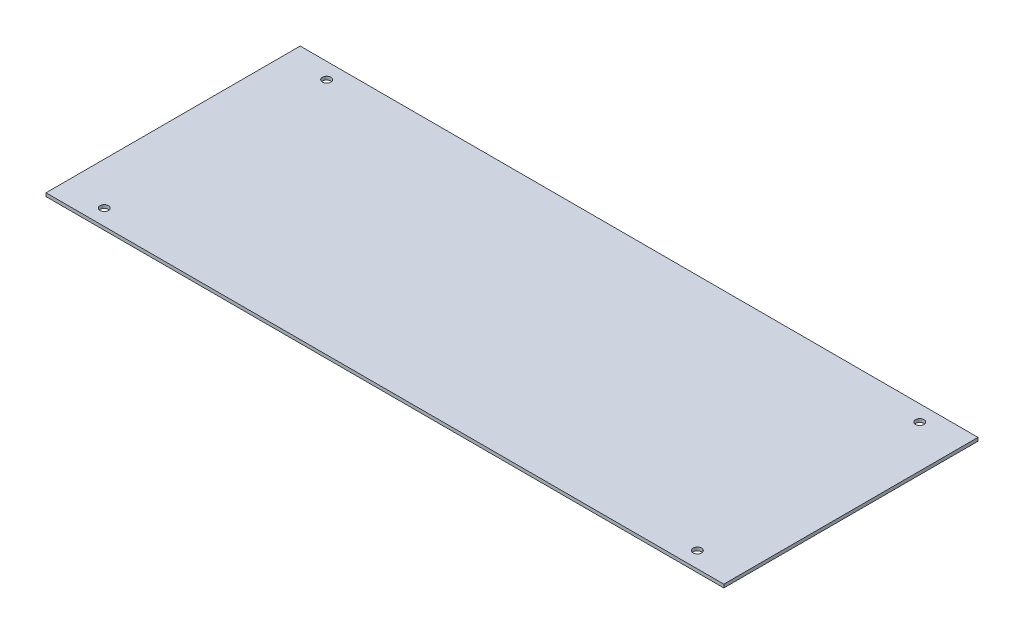
ISO-10303-21;
HEADER;
FILE_DESCRIPTION(('STEP AP214'),'2;1');
FILE_NAME('part.step','',(''),(''),'','','');
FILE_SCHEMA(('AUTOMOTIVE_DESIGN { 1 0 10303 214 1 1 1 1 }'));
ENDSEC;
DATA;
#1=APPLICATION_CONTEXT('core data for automotive mechanical design processes');
#2=APPLICATION_PROTOCOL_DEFINITION('international standard','automotive_design',2000,#1);
#3=PRODUCT_CONTEXT('',#1,'mechanical');
#4=PRODUCT('Part','Part','',(#3));
#5=PRODUCT_RELATED_PRODUCT_CATEGORY('part','',(#4));
#6=PRODUCT_DEFINITION_FORMATION('','',#4);
#7=PRODUCT_DEFINITION_CONTEXT('part definition',#1,'design');
#8=PRODUCT_DEFINITION('design','',#6,#7);
#9=PRODUCT_DEFINITION_SHAPE('','',#8);
#10=(LENGTH_UNIT() NAMED_UNIT(*) SI_UNIT(.MILLI.,.METRE.));
#11=(NAMED_UNIT(*) PLANE_ANGLE_UNIT() SI_UNIT($,.RADIAN.));
#12=(NAMED_UNIT(*) SI_UNIT($,.STERADIAN.) SOLID_ANGLE_UNIT());
#13=UNCERTAINTY_MEASURE_WITH_UNIT(LENGTH_MEASURE(1.E-05),#10,'distance_accuracy_value','');
#14=(GEOMETRIC_REPRESENTATION_CONTEXT(3) GLOBAL_UNCERTAINTY_ASSIGNED_CONTEXT((#13)) GLOBAL_UNIT_ASSIGNED_CONTEXT((#10,
#11,#12)) REPRESENTATION_CONTEXT('',''));
#15=CARTESIAN_POINT('',(0.,0.,0.));
#16=DIRECTION('',(0.,0.,1.));
#17=DIRECTION('',(1.,0.,0.));
#18=AXIS2_PLACEMENT_3D('',#15,#16,#17);
#19=CARTESIAN_POINT('',(0.,0.5,0.));
#20=DIRECTION('',(0.,1.,0.));
#21=DIRECTION('',(0.,0.,1.));
#22=AXIS2_PLACEMENT_3D('',#19,#20,#21);
#23=PLANE('',#22);
#24=CARTESIAN_POINT('',(-44.45,0.5,-16.66875));
#25=DIRECTION('',(0.,1.,0.));
#26=DIRECTION('',(0.,0.,1.));
#27=AXIS2_PLACEMENT_3D('',#24,#25,#26);
#28=CIRCLE('',#27,0.634999999999995);
#29=CARTESIAN_POINT('',(-44.45,0.5,-16.03375));
#30=VERTEX_POINT('',#29);
#31=EDGE_CURVE('E121',#30,#30,#28,.T.);
#32=ORIENTED_EDGE('',*,*,#31,.F.);
#33=EDGE_LOOP('',(#32));
#34=FACE_BOUND('',#33,.T.);
#35=CARTESIAN_POINT('',(44.45,0.5,-16.66875));
#36=DIRECTION('',(0.,1.,0.));
#37=DIRECTION('',(0.,0.,1.));
#38=AXIS2_PLACEMENT_3D('',#35,#36,#37);
#39=CIRCLE('',#38,0.634999999999995);
#40=CARTESIAN_POINT('',(44.45,0.5,-16.03375));
#41=VERTEX_POINT('',#40);
#42=EDGE_CURVE('E100',#41,#41,#39,.T.);
#43=ORIENTED_EDGE('',*,*,#42,.F.);
#44=EDGE_LOOP('',(#43));
#45=FACE_BOUND('',#44,.T.);
#46=DIRECTION('',(0.,0.,-1.));
#47=VECTOR('',#46,1.);
#48=CARTESIAN_POINT('',(50.8,0.5,-19.05));
#49=LINE('',#48,#47);
#50=CARTESIAN_POINT('',(50.8,0.5,19.05));
#51=VERTEX_POINT('',#50);
#52=CARTESIAN_POINT('',(50.8,0.5,-19.05));
#53=VERTEX_POINT('',#52);
#54=EDGE_CURVE('E85',#51,#53,#49,.T.);
#55=ORIENTED_EDGE('',*,*,#54,.T.);
#56=DIRECTION('',(-1.,0.,0.));
#57=VECTOR('',#56,1.);
#58=CARTESIAN_POINT('',(-50.8,0.5,-19.05));
#59=LINE('',#58,#57);
#60=CARTESIAN_POINT('',(-50.8,0.5,-19.05));
#61=VERTEX_POINT('',#60);
#62=EDGE_CURVE('E80',#53,#61,#59,.T.);
#63=ORIENTED_EDGE('',*,*,#62,.T.);
#64=DIRECTION('',(0.,0.,1.));
#65=VECTOR('',#64,1.);
#66=CARTESIAN_POINT('',(-50.8,0.5,-19.05));
#67=LINE('',#66,#65);
#68=CARTESIAN_POINT('',(-50.8,0.5,19.05));
#69=VERTEX_POINT('',#68);
#70=EDGE_CURVE('E83',#61,#69,#67,.T.);
#71=ORIENTED_EDGE('',*,*,#70,.T.);
#72=DIRECTION('',(1.,0.,0.));
#73=VECTOR('',#72,1.);
#74=CARTESIAN_POINT('',(-50.8,0.5,19.05));
#75=LINE('',#74,#73);
#76=EDGE_CURVE('E50',#69,#51,#75,.T.);
#77=ORIENTED_EDGE('',*,*,#76,.T.);
#78=EDGE_LOOP('',(#55,#63,#71,#77));
#79=FACE_BOUND('',#78,.T.);
#80=CARTESIAN_POINT('',(44.45,0.5,16.66875));
#81=DIRECTION('',(0.,1.,0.));
#82=DIRECTION('',(0.,0.,1.));
#83=AXIS2_PLACEMENT_3D('',#80,#81,#82);
#84=CIRCLE('',#83,0.634999999999995);
#85=CARTESIAN_POINT('',(44.45,0.5,17.30375));
#86=VERTEX_POINT('',#85);
#87=EDGE_CURVE('E115',#86,#86,#84,.T.);
#88=ORIENTED_EDGE('',*,*,#87,.F.);
#89=EDGE_LOOP('',(#88));
#90=FACE_BOUND('',#89,.T.);
#91=CARTESIAN_POINT('',(-44.4499999999999,0.5,16.66875));
#92=DIRECTION('',(0.,1.,0.));
#93=DIRECTION('',(0.,0.,1.));
#94=AXIS2_PLACEMENT_3D('',#91,#92,#93);
#95=CIRCLE('',#94,0.634999999999995);
#96=CARTESIAN_POINT('',(-44.4499999999999,0.5,17.30375));
#97=VERTEX_POINT('',#96);
#98=EDGE_CURVE('E127',#97,#97,#95,.T.);
#99=ORIENTED_EDGE('',*,*,#98,.F.);
#100=EDGE_LOOP('',(#99));
#101=FACE_BOUND('',#100,.T.);
#102=ADVANCED_FACE('F33',(#34,#45,#79,#90,#101),#23,.T.);
#103=CARTESIAN_POINT('',(0.,0.,0.));
#104=DIRECTION('',(0.,1.,0.));
#105=DIRECTION('',(0.,0.,1.));
#106=AXIS2_PLACEMENT_3D('',#103,#104,#105);
#107=PLANE('',#106);
#108=DIRECTION('',(0.,0.,-1.));
#109=VECTOR('',#108,1.);
#110=CARTESIAN_POINT('',(50.8,0.,-19.05));
#111=LINE('',#110,#109);
#112=CARTESIAN_POINT('',(50.8,0.,19.05));
#113=VERTEX_POINT('',#112);
#114=CARTESIAN_POINT('',(50.8,0.,-19.05));
#115=VERTEX_POINT('',#114);
#116=EDGE_CURVE('E97',#113,#115,#111,.T.);
#117=ORIENTED_EDGE('',*,*,#116,.F.);
#118=DIRECTION('',(1.,0.,0.));
#119=VECTOR('',#118,1.);
#120=CARTESIAN_POINT('',(-50.8,0.,19.05));
#121=LINE('',#120,#119);
#122=CARTESIAN_POINT('',(-50.8,0.,19.05));
#123=VERTEX_POINT('',#122);
#124=EDGE_CURVE('E73',#123,#113,#121,.T.);
#125=ORIENTED_EDGE('',*,*,#124,.F.);
#126=DIRECTION('',(0.,0.,1.));
#127=VECTOR('',#126,1.);
#128=CARTESIAN_POINT('',(-50.8,0.,-19.05));
#129=LINE('',#128,#127);
#130=CARTESIAN_POINT('',(-50.8,0.,-19.05));
#131=VERTEX_POINT('',#130);
#132=EDGE_CURVE('E67',#131,#123,#129,.T.);
#133=ORIENTED_EDGE('',*,*,#132,.F.);
#134=DIRECTION('',(-1.,0.,0.));
#135=VECTOR('',#134,1.);
#136=CARTESIAN_POINT('',(-50.8,0.,-19.05));
#137=LINE('',#136,#135);
#138=EDGE_CURVE('E89',#115,#131,#137,.T.);
#139=ORIENTED_EDGE('',*,*,#138,.F.);
#140=EDGE_LOOP('',(#117,#125,#133,#139));
#141=FACE_BOUND('',#140,.T.);
#142=CARTESIAN_POINT('',(44.45,0.,-16.66875));
#143=DIRECTION('',(0.,1.,0.));
#144=DIRECTION('',(0.,0.,1.));
#145=AXIS2_PLACEMENT_3D('',#142,#143,#144);
#146=CIRCLE('',#145,0.634999999999995);
#147=CARTESIAN_POINT('',(44.45,0.,-16.03375));
#148=VERTEX_POINT('',#147);
#149=EDGE_CURVE('E112',#148,#148,#146,.T.);
#150=ORIENTED_EDGE('',*,*,#149,.T.);
#151=EDGE_LOOP('',(#150));
#152=FACE_BOUND('',#151,.T.);
#153=CARTESIAN_POINT('',(44.45,0.,16.66875));
#154=DIRECTION('',(0.,1.,0.));
#155=DIRECTION('',(0.,0.,1.));
#156=AXIS2_PLACEMENT_3D('',#153,#154,#155);
#157=CIRCLE('',#156,0.634999999999995);
#158=CARTESIAN_POINT('',(44.45,0.,17.30375));
#159=VERTEX_POINT('',#158);
#160=EDGE_CURVE('E118',#159,#159,#157,.T.);
#161=ORIENTED_EDGE('',*,*,#160,.T.);
#162=EDGE_LOOP('',(#161));
#163=FACE_BOUND('',#162,.T.);
#164=CARTESIAN_POINT('',(-44.45,0.,-16.66875));
#165=DIRECTION('',(0.,1.,0.));
#166=DIRECTION('',(0.,0.,1.));
#167=AXIS2_PLACEMENT_3D('',#164,#165,#166);
#168=CIRCLE('',#167,0.634999999999995);
#169=CARTESIAN_POINT('',(-44.45,0.,-16.03375));
#170=VERTEX_POINT('',#169);
#171=EDGE_CURVE('E124',#170,#170,#168,.T.);
#172=ORIENTED_EDGE('',*,*,#171,.T.);
#173=EDGE_LOOP('',(#172));
#174=FACE_BOUND('',#173,.T.);
#175=CARTESIAN_POINT('',(-44.4499999999999,0.,16.66875));
#176=DIRECTION('',(0.,1.,0.));
#177=DIRECTION('',(0.,0.,1.));
#178=AXIS2_PLACEMENT_3D('',#175,#176,#177);
#179=CIRCLE('',#178,0.634999999999995);
#180=CARTESIAN_POINT('',(-44.4499999999999,0.,17.30375));
#181=VERTEX_POINT('',#180);
#182=EDGE_CURVE('E130',#181,#181,#179,.T.);
#183=ORIENTED_EDGE('',*,*,#182,.T.);
#184=EDGE_LOOP('',(#183));
#185=FACE_BOUND('',#184,.T.);
#186=ADVANCED_FACE('F108',(#141,#152,#163,#174,#185),#107,.F.);
#187=CARTESIAN_POINT('',(50.8,0.5,-19.05));
#188=DIRECTION('',(-1.,0.,0.));
#189=DIRECTION('',(0.,0.,1.));
#190=AXIS2_PLACEMENT_3D('',#187,#188,#189);
#191=PLANE('',#190);
#192=ORIENTED_EDGE('',*,*,#116,.T.);
#193=DIRECTION('',(0.,-1.,0.));
#194=VECTOR('',#193,1.);
#195=CARTESIAN_POINT('',(50.8,0.5,-19.05));
#196=LINE('',#195,#194);
#197=EDGE_CURVE('E11',#53,#115,#196,.T.);
#198=ORIENTED_EDGE('',*,*,#197,.F.);
#199=ORIENTED_EDGE('',*,*,#54,.F.);
#200=DIRECTION('',(0.,-1.,0.));
#201=VECTOR('',#200,1.);
#202=CARTESIAN_POINT('',(50.8,0.5,19.05));
#203=LINE('',#202,#201);
#204=EDGE_CURVE('E93',#51,#113,#203,.T.);
#205=ORIENTED_EDGE('',*,*,#204,.T.);
#206=EDGE_LOOP('',(#192,#198,#199,#205));
#207=FACE_BOUND('',#206,.T.);
#208=ADVANCED_FACE('F35',(#207),#191,.F.);
#209=CARTESIAN_POINT('',(-50.8,0.5,-19.05));
#210=DIRECTION('',(0.,0.,1.));
#211=DIRECTION('',(1.,0.,0.));
#212=AXIS2_PLACEMENT_3D('',#209,#210,#211);
#213=PLANE('',#212);
#214=ORIENTED_EDGE('',*,*,#138,.T.);
#215=DIRECTION('',(0.,-1.,0.));
#216=VECTOR('',#215,1.);
#217=CARTESIAN_POINT('',(-50.8,0.5,-19.05));
#218=LINE('',#217,#216);
#219=EDGE_CURVE('E42',#61,#131,#218,.T.);
#220=ORIENTED_EDGE('',*,*,#219,.F.);
#221=ORIENTED_EDGE('',*,*,#62,.F.);
#222=ORIENTED_EDGE('',*,*,#197,.T.);
#223=EDGE_LOOP('',(#214,#220,#221,#222));
#224=FACE_BOUND('',#223,.T.);
#225=ADVANCED_FACE('F88',(#224),#213,.F.);
#226=CARTESIAN_POINT('',(-50.8,0.5,-19.05));
#227=DIRECTION('',(1.,0.,0.));
#228=DIRECTION('',(0.,0.,-1.));
#229=AXIS2_PLACEMENT_3D('',#226,#227,#228);
#230=PLANE('',#229);
#231=ORIENTED_EDGE('',*,*,#132,.T.);
#232=DIRECTION('',(0.,-1.,0.));
#233=VECTOR('',#232,1.);
#234=CARTESIAN_POINT('',(-50.8,0.5,19.05));
#235=LINE('',#234,#233);
#236=EDGE_CURVE('E90',#69,#123,#235,.T.);
#237=ORIENTED_EDGE('',*,*,#236,.F.);
#238=ORIENTED_EDGE('',*,*,#70,.F.);
#239=ORIENTED_EDGE('',*,*,#219,.T.);
#240=EDGE_LOOP('',(#231,#237,#238,#239));
#241=FACE_BOUND('',#240,.T.);
#242=ADVANCED_FACE('F91',(#241),#230,.F.);
#243=CARTESIAN_POINT('',(-50.8,0.5,19.05));
#244=DIRECTION('',(0.,0.,-1.));
#245=DIRECTION('',(-1.,0.,0.));
#246=AXIS2_PLACEMENT_3D('',#243,#244,#245);
#247=PLANE('',#246);
#248=ORIENTED_EDGE('',*,*,#124,.T.);
#249=ORIENTED_EDGE('',*,*,#204,.F.);
#250=ORIENTED_EDGE('',*,*,#76,.F.);
#251=ORIENTED_EDGE('',*,*,#236,.T.);
#252=EDGE_LOOP('',(#248,#249,#250,#251));
#253=FACE_BOUND('',#252,.T.);
#254=ADVANCED_FACE('F105',(#253),#247,.F.);
#255=CARTESIAN_POINT('',(44.45,0.5,-16.66875));
#256=DIRECTION('',(0.,-1.,0.));
#257=DIRECTION('',(0.,0.,-1.));
#258=AXIS2_PLACEMENT_3D('',#255,#256,#257);
#259=CYLINDRICAL_SURFACE('',#258,0.634999999999995);
#260=ORIENTED_EDGE('',*,*,#42,.T.);
#261=EDGE_LOOP('',(#260));
#262=FACE_BOUND('',#261,.T.);
#263=ORIENTED_EDGE('',*,*,#149,.F.);
#264=EDGE_LOOP('',(#263));
#265=FACE_BOUND('',#264,.T.);
#266=ADVANCED_FACE('F149',(#262,#265),#259,.F.);
#267=CARTESIAN_POINT('',(44.45,0.5,16.66875));
#268=DIRECTION('',(0.,-1.,0.));
#269=DIRECTION('',(0.,0.,-1.));
#270=AXIS2_PLACEMENT_3D('',#267,#268,#269);
#271=CYLINDRICAL_SURFACE('',#270,0.634999999999995);
#272=ORIENTED_EDGE('',*,*,#87,.T.);
#273=EDGE_LOOP('',(#272));
#274=FACE_BOUND('',#273,.T.);
#275=ORIENTED_EDGE('',*,*,#160,.F.);
#276=EDGE_LOOP('',(#275));
#277=FACE_BOUND('',#276,.T.);
#278=ADVANCED_FACE('F195',(#274,#277),#271,.F.);
#279=CARTESIAN_POINT('',(-44.45,0.5,-16.66875));
#280=DIRECTION('',(0.,-1.,0.));
#281=DIRECTION('',(0.,0.,-1.));
#282=AXIS2_PLACEMENT_3D('',#279,#280,#281);
#283=CYLINDRICAL_SURFACE('',#282,0.634999999999995);
#284=ORIENTED_EDGE('',*,*,#31,.T.);
#285=EDGE_LOOP('',(#284));
#286=FACE_BOUND('',#285,.T.);
#287=ORIENTED_EDGE('',*,*,#171,.F.);
#288=EDGE_LOOP('',(#287));
#289=FACE_BOUND('',#288,.T.);
#290=ADVANCED_FACE('F203',(#286,#289),#283,.F.);
#291=CARTESIAN_POINT('',(-44.4499999999999,0.5,16.66875));
#292=DIRECTION('',(0.,-1.,0.));
#293=DIRECTION('',(0.,0.,-1.));
#294=AXIS2_PLACEMENT_3D('',#291,#292,#293);
#295=CYLINDRICAL_SURFACE('',#294,0.634999999999995);
#296=ORIENTED_EDGE('',*,*,#98,.T.);
#297=EDGE_LOOP('',(#296));
#298=FACE_BOUND('',#297,.T.);
#299=ORIENTED_EDGE('',*,*,#182,.F.);
#300=EDGE_LOOP('',(#299));
#301=FACE_BOUND('',#300,.T.);
#302=ADVANCED_FACE('F136',(#298,#301),#295,.F.);
#303=CLOSED_SHELL('',(#102,#186,#208,#225,#242,#254,#266,#278,#290,#302));
#304=MANIFOLD_SOLID_BREP('B2',#303);
#305=ADVANCED_BREP_SHAPE_REPRESENTATION('',(#18,#304),#14);
#306=SHAPE_DEFINITION_REPRESENTATION(#9,#305);
ENDSEC;
END-ISO-10303-21;
